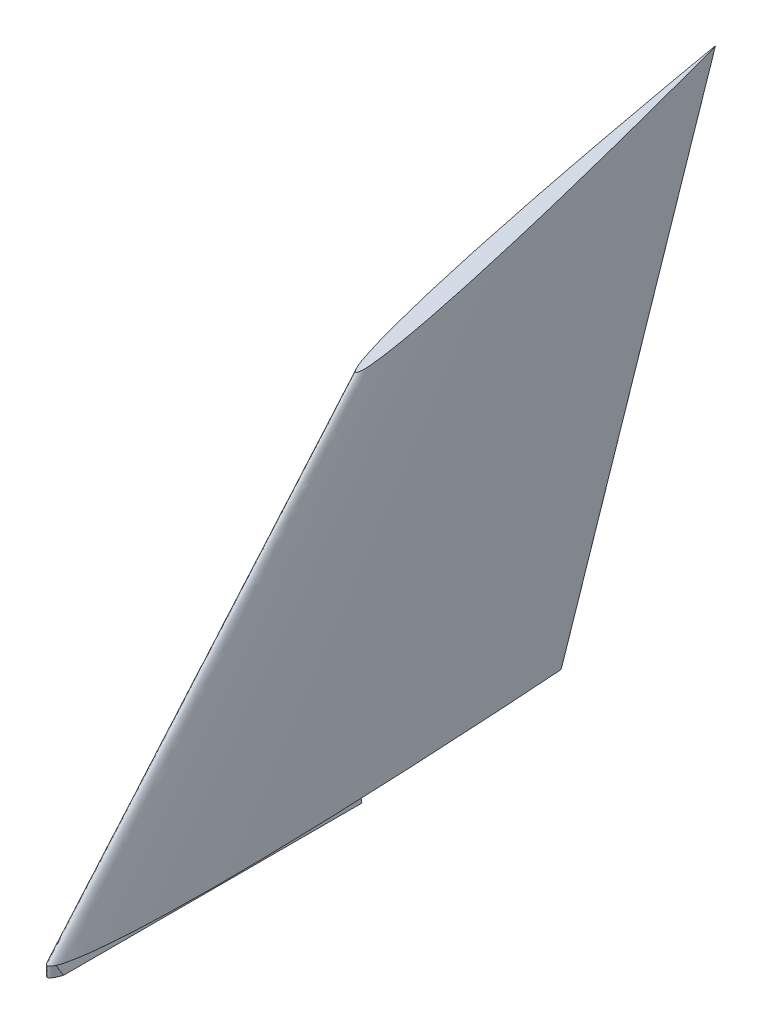
ISO-10303-21;
HEADER;
FILE_DESCRIPTION(('STEP AP214'),'2;1');
FILE_NAME('part.step','',(''),(''),'','','');
FILE_SCHEMA(('AUTOMOTIVE_DESIGN { 1 0 10303 214 1 1 1 1 }'));
ENDSEC;
DATA;
#1=APPLICATION_CONTEXT('core data for automotive mechanical design processes');
#2=APPLICATION_PROTOCOL_DEFINITION('international standard','automotive_design',2000,#1);
#3=PRODUCT_CONTEXT('',#1,'mechanical');
#4=PRODUCT('Part','Part','',(#3));
#5=PRODUCT_RELATED_PRODUCT_CATEGORY('part','',(#4));
#6=PRODUCT_DEFINITION_FORMATION('','',#4);
#7=PRODUCT_DEFINITION_CONTEXT('part definition',#1,'design');
#8=PRODUCT_DEFINITION('design','',#6,#7);
#9=PRODUCT_DEFINITION_SHAPE('','',#8);
#10=(LENGTH_UNIT() NAMED_UNIT(*) SI_UNIT(.MILLI.,.METRE.));
#11=(NAMED_UNIT(*) PLANE_ANGLE_UNIT() SI_UNIT($,.RADIAN.));
#12=(NAMED_UNIT(*) SI_UNIT($,.STERADIAN.) SOLID_ANGLE_UNIT());
#13=UNCERTAINTY_MEASURE_WITH_UNIT(LENGTH_MEASURE(1.E-05),#10,'distance_accuracy_value','');
#14=(GEOMETRIC_REPRESENTATION_CONTEXT(3) GLOBAL_UNCERTAINTY_ASSIGNED_CONTEXT((#13)) GLOBAL_UNIT_ASSIGNED_CONTEXT((#10,
#11,#12)) REPRESENTATION_CONTEXT('',''));
#15=CARTESIAN_POINT('',(0.,0.,0.));
#16=DIRECTION('',(0.,0.,1.));
#17=DIRECTION('',(1.,0.,0.));
#18=AXIS2_PLACEMENT_3D('',#15,#16,#17);
#19=CARTESIAN_POINT('',(0.4,0.,-30.));
#20=DIRECTION('',(0.98058067569092,0.196116135138184,0.));
#21=DIRECTION('',(-0.196116135138184,0.98058067569092,0.));
#22=AXIS2_PLACEMENT_3D('',#19,#20,#21);
#23=PLANE('',#22);
#24=DIRECTION('',(0.,0.,1.));
#25=VECTOR('',#24,1.);
#26=CARTESIAN_POINT('',(0.4,0.,-30.));
#27=LINE('',#26,#25);
#28=CARTESIAN_POINT('',(0.4,0.,-30.));
#29=VERTEX_POINT('',#28);
#30=CARTESIAN_POINT('',(0.399999999999814,0.,-0.454209676102204));
#31=VERTEX_POINT('',#30);
#32=EDGE_CURVE('E136',#29,#31,#27,.T.);
#33=ORIENTED_EDGE('',*,*,#32,.T.);
#34=CARTESIAN_POINT('',(0.399999999999901,0.,-0.454209676102168));
#35=CARTESIAN_POINT('',(0.408837300473484,-0.0441865023675952,-0.473053496078145));
#36=CARTESIAN_POINT('',(0.417634885450178,-0.0881744272509356,-0.492384061262309));
#37=CARTESIAN_POINT('',(0.435120510597668,-0.175602552988291,-0.531996119925799));
#38=CARTESIAN_POINT('',(0.443808772444676,-0.219043862223365,-0.552275070244527));
#39=CARTESIAN_POINT('',(0.46107307693216,-0.305365384660813,-0.593814586369523));
#40=CARTESIAN_POINT('',(0.46964931196724,-0.348246559836205,-0.61507307048998));
#41=CARTESIAN_POINT('',(0.486680959276207,-0.433404796381029,-0.658668969025825));
#42=CARTESIAN_POINT('',(0.495136523983628,-0.47568261991814,-0.681004830200858));
#43=CARTESIAN_POINT('',(0.511919557646701,-0.559597788233508,-0.727010122576347));
#44=CARTESIAN_POINT('',(0.520246875417697,-0.601234377088484,-0.750680994098539));
#45=CARTESIAN_POINT('',(0.536733319830674,-0.683666599153368,-0.799554600671502));
#46=CARTESIAN_POINT('',(0.544892357253607,-0.724461786268035,-0.82475812169643));
#47=CARTESIAN_POINT('',(0.561010746280223,-0.805053731401116,-0.876950165981431));
#48=CARTESIAN_POINT('',(0.568969685720734,-0.844848428603668,-0.903942013951729));
#49=CARTESIAN_POINT('',(0.584667672756584,-0.923338363782923,-0.95986167386739));
#50=CARTESIAN_POINT('',(0.592405736965954,-0.962028684829772,-0.98879665458486));
#51=CARTESIAN_POINT('',(0.599999999999998,-1.,-1.01869509705227));
#52=B_SPLINE_CURVE_WITH_KNOTS('',3,(#34,#35,#36,#37,#38,#39,#40,#41,#42,#43,#44,#45,#46,#47,#48,
#49,#50,#51),.UNSPECIFIED.,.F.,.F.,(4,2,2,2,2,2,2,2,4),(0.,0.146527403375212,0.292682195649871,
0.438539546633658,0.584192560073215,0.730005839580249,0.875894536249937,1.02206251109652,
1.16880300336692),.UNSPECIFIED.);
#53=CARTESIAN_POINT('',(0.600000015158689,-0.999999999999997,-1.01869515662808));
#54=VERTEX_POINT('',#53);
#55=EDGE_CURVE('E163',#31,#54,#52,.T.);
#56=ORIENTED_EDGE('',*,*,#55,.T.);
#57=DIRECTION('',(0.,0.,1.));
#58=VECTOR('',#57,1.);
#59=CARTESIAN_POINT('',(0.6,-1.,-30.));
#60=LINE('',#59,#58);
#61=CARTESIAN_POINT('',(0.6,-1.,-30.));
#62=VERTEX_POINT('',#61);
#63=EDGE_CURVE('E83',#62,#54,#60,.T.);
#64=ORIENTED_EDGE('',*,*,#63,.F.);
#65=DIRECTION('',(-0.196116135138184,0.98058067569092,0.));
#66=VECTOR('',#65,1.);
#67=CARTESIAN_POINT('',(0.4,0.,-30.));
#68=LINE('',#67,#66);
#69=EDGE_CURVE('E160',#62,#29,#68,.T.);
#70=ORIENTED_EDGE('',*,*,#69,.T.);
#71=EDGE_LOOP('',(#33,#56,#64,#70));
#72=FACE_BOUND('',#71,.T.);
#73=ADVANCED_FACE('F55',(#72),#23,.T.);
#74=CARTESIAN_POINT('',(-0.6,-1.,-30.));
#75=DIRECTION('',(0.,-1.,0.));
#76=DIRECTION('',(1.,0.,0.));
#77=AXIS2_PLACEMENT_3D('',#74,#75,#76);
#78=PLANE('',#77);
#79=ORIENTED_EDGE('',*,*,#63,.T.);
#80=CARTESIAN_POINT('',(-3.49160533385379E-13,-0.999999999999997,-50.));
#81=CARTESIAN_POINT('',(-0.070574794145528,-0.999999999999997,-50.));
#82=CARTESIAN_POINT('',(-0.211641076447674,-0.999999999999997,-47.1254578243524));
#83=CARTESIAN_POINT('',(-0.41198278936694,-0.999999999999997,-44.3840026286243));
#84=CARTESIAN_POINT('',(-0.663217827529071,-0.999999999999997,-39.9273470933078));
#85=CARTESIAN_POINT('',(-0.921106295060571,-0.999999999999997,-35.0205451655395));
#86=CARTESIAN_POINT('',(-1.14810694191173,-0.999999999999997,-29.9955902414363));
#87=CARTESIAN_POINT('',(-1.33225353387247,-0.999999999999997,-25.0022698373491));
#88=CARTESIAN_POINT('',(-1.46372016882197,-0.999999999999997,-20.0003386554011));
#89=CARTESIAN_POINT('',(-1.50961292044442,-0.999999999999997,-15.8334758537308));
#90=CARTESIAN_POINT('',(-1.49145088504206,-0.999999999999997,-12.4997333719351));
#91=CARTESIAN_POINT('',(-1.44210087645863,-0.999999999999997,-9.99945032426333));
#92=CARTESIAN_POINT('',(-1.34700278680778,-0.999999999999997,-7.49784702287007));
#93=CARTESIAN_POINT('',(-1.21482098047477,-0.999999999999997,-5.41578108448594));
#94=CARTESIAN_POINT('',(-1.05484298707573,-0.999999999999997,-3.74540160747368));
#95=CARTESIAN_POINT('',(-0.904008723191611,-0.999999999999997,-2.50391511144424));
#96=CARTESIAN_POINT('',(-0.696273378383395,-0.999999999999997,-1.42183800740736));
#97=CARTESIAN_POINT('',(-0.512523451047769,-0.999999999999997,-0.628600996921929));
#98=CARTESIAN_POINT('',(0.,-0.999999999999997,0.343595251004143));
#99=CARTESIAN_POINT('',(0.512523451047759,-0.999999999999997,-0.628600996921931));
#100=CARTESIAN_POINT('',(0.696273378383378,-0.999999999999997,-1.42183800740738));
#101=CARTESIAN_POINT('',(0.904008723191574,-0.999999999999997,-2.50391511144425));
#102=CARTESIAN_POINT('',(1.05484298707568,-0.999999999999997,-3.7454016074737));
#103=CARTESIAN_POINT('',(1.21482098047469,-0.999999999999997,-5.41578108448596));
#104=CARTESIAN_POINT('',(1.34700278680768,-0.999999999999997,-7.49784702287008));
#105=CARTESIAN_POINT('',(1.44210087645849,-0.999999999999997,-9.99945032426334));
#106=CARTESIAN_POINT('',(1.49145088504189,-0.999999999999997,-12.4997333719352));
#107=CARTESIAN_POINT('',(1.5096129204442,-0.999999999999997,-15.8334758537308));
#108=CARTESIAN_POINT('',(1.46372016882169,-0.999999999999997,-20.0003386554012));
#109=CARTESIAN_POINT('',(1.33225353387212,-0.999999999999997,-25.0022698373491));
#110=CARTESIAN_POINT('',(1.14810694191131,-0.999999999999997,-29.9955902414363));
#111=CARTESIAN_POINT('',(0.921106295060082,-0.999999999999997,-35.0205451655395));
#112=CARTESIAN_POINT('',(0.663217827528514,-0.999999999999997,-39.9273470933078));
#113=CARTESIAN_POINT('',(0.411982789366322,-0.999999999999997,-44.3840026286243));
#114=CARTESIAN_POINT('',(0.211641076447015,-0.999999999999997,-47.1254578243524));
#115=CARTESIAN_POINT('',(0.0705747941448297,-0.999999999999997,-50.));
#116=CARTESIAN_POINT('',(-3.49160533385379E-13,-0.999999999999997,-50.));
#117=B_SPLINE_CURVE_WITH_KNOTS('',3,(#80,#81,#82,#83,#84,#85,#86,#87,#88,#89,#90,#91,#92,#93,
#94,#95,#96,#97,#98,#99,#100,#101,#102,#103,#104,#105,#106,#107,#108,#109,#110,#111,#112,#113,
#114,#115,#116),.UNSPECIFIED.,.T.,.F.,(4,1,1,1,1,1,1,1,1,1,1,1,1,1,1,1,1,1,1,1,1,1,1,1,1,1,1,1,
1,1,1,1,1,1,4),(0.,0.0249466151164409,0.0498637834247188,0.099681635264649,0.149480780874934,
0.199263062412575,0.249028132484341,0.298776252358612,0.348510642813833,0.373377067097664,
0.398248217372172,0.423133291765915,0.448054024726348,0.460544649115496,0.473080977694483,
0.485731773975164,0.492200943481806,0.5,0.507799056518194,0.514268226024836,0.526919022305516,
0.539455350884504,0.551945975273652,0.576866708234085,0.601751782627828,0.626622932902336,
0.651489357186167,0.701223747641388,0.750971867515659,0.800736937587425,0.850519219125066,
0.900318364735351,0.950136216575281,0.975053384883559,1.),.UNSPECIFIED.);
#118=CARTESIAN_POINT('',(-0.60000001515869,-0.999999999999997,-1.01869515662802));
#119=VERTEX_POINT('',#118);
#120=EDGE_CURVE('E130',#54,#119,#117,.F.);
#121=ORIENTED_EDGE('',*,*,#120,.T.);
#122=DIRECTION('',(0.,0.,1.));
#123=VECTOR('',#122,1.);
#124=CARTESIAN_POINT('',(-0.6,-1.,-30.));
#125=LINE('',#124,#123);
#126=CARTESIAN_POINT('',(-0.6,-1.,-30.));
#127=VERTEX_POINT('',#126);
#128=EDGE_CURVE('E128',#127,#119,#125,.T.);
#129=ORIENTED_EDGE('',*,*,#128,.F.);
#130=DIRECTION('',(1.,0.,0.));
#131=VECTOR('',#130,1.);
#132=CARTESIAN_POINT('',(-0.6,-1.,-30.));
#133=LINE('',#132,#131);
#134=EDGE_CURVE('E142',#127,#62,#133,.T.);
#135=ORIENTED_EDGE('',*,*,#134,.T.);
#136=EDGE_LOOP('',(#79,#121,#129,#135));
#137=FACE_BOUND('',#136,.T.);
#138=ADVANCED_FACE('F204',(#137),#78,.T.);
#139=CARTESIAN_POINT('',(-0.6,-1.,-30.));
#140=DIRECTION('',(-0.98058067569092,0.196116135138184,0.));
#141=DIRECTION('',(-0.196116135138184,-0.98058067569092,0.));
#142=AXIS2_PLACEMENT_3D('',#139,#140,#141);
#143=PLANE('',#142);
#144=ORIENTED_EDGE('',*,*,#128,.T.);
#145=CARTESIAN_POINT('',(-0.6,-0.999999999999999,-1.01869509705221));
#146=CARTESIAN_POINT('',(-0.592405736986242,-0.962028684931211,-0.988796654664981));
#147=CARTESIAN_POINT('',(-0.584667672797956,-0.923338363989782,-0.959861674022255));
#148=CARTESIAN_POINT('',(-0.568969685805341,-0.844848429026704,-0.903942014245736));
#149=CARTESIAN_POINT('',(-0.561010746386974,-0.805053731934868,-0.876950166339899));
#150=CARTESIAN_POINT('',(-0.544892357405485,-0.724461787027425,-0.824758122175213));
#151=CARTESIAN_POINT('',(-0.536733320005533,-0.683666600027667,-0.799554601206164));
#152=CARTESIAN_POINT('',(-0.520246875639106,-0.601234378195531,-0.750680994738556));
#153=CARTESIAN_POINT('',(-0.511919557891679,-0.559597789458392,-0.727010123265844));
#154=CARTESIAN_POINT('',(-0.495136524276056,-0.47568262138028,-0.681004830984453));
#155=CARTESIAN_POINT('',(-0.486680959592517,-0.433404797962583,-0.658668969854048));
#156=CARTESIAN_POINT('',(-0.469649312331655,-0.348246561658274,-0.615073071403956));
#157=CARTESIAN_POINT('',(-0.461073077320797,-0.305365386603987,-0.593814587324613));
#158=CARTESIAN_POINT('',(-0.443808772882201,-0.219043864411007,-0.552275071277253));
#159=CARTESIAN_POINT('',(-0.43512051105986,-0.175602555299301,-0.531996120995032));
#160=CARTESIAN_POINT('',(-0.417634885962181,-0.0881744298109035,-0.492384062400034));
#161=CARTESIAN_POINT('',(-0.408837301010631,-0.0441865050531612,-0.473053497247837));
#162=CARTESIAN_POINT('',(-0.40000000056237,-2.81186212025506E-09,-0.454209677301459));
#163=B_SPLINE_CURVE_WITH_KNOTS('',3,(#145,#146,#147,#148,#149,#150,#151,#152,#153,#154,#155,
#156,#157,#158,#159,#160,#161,#162),.UNSPECIFIED.,.F.,.F.,(4,2,2,2,2,2,2,2,4),(0.,
0.146740491878042,0.292908466335859,0.438797162618223,0.584610441738217,0.730263454791862,
0.876120805388567,1.02227559727454,1.16880300025899),.UNSPECIFIED.);
#164=CARTESIAN_POINT('',(-0.399999999999998,0.,-0.454209676102577));
#165=VERTEX_POINT('',#164);
#166=EDGE_CURVE('E119',#119,#165,#163,.T.);
#167=ORIENTED_EDGE('',*,*,#166,.T.);
#168=DIRECTION('',(0.,0.,1.));
#169=VECTOR('',#168,1.);
#170=CARTESIAN_POINT('',(-0.4,0.,-30.));
#171=LINE('',#170,#169);
#172=CARTESIAN_POINT('',(-0.4,0.,-30.));
#173=VERTEX_POINT('',#172);
#174=EDGE_CURVE('E126',#173,#165,#171,.T.);
#175=ORIENTED_EDGE('',*,*,#174,.F.);
#176=DIRECTION('',(-0.196116135138184,-0.98058067569092,0.));
#177=VECTOR('',#176,1.);
#178=CARTESIAN_POINT('',(-0.6,-1.,-30.));
#179=LINE('',#178,#177);
#180=EDGE_CURVE('E155',#173,#127,#179,.T.);
#181=ORIENTED_EDGE('',*,*,#180,.T.);
#182=EDGE_LOOP('',(#144,#167,#175,#181));
#183=FACE_BOUND('',#182,.T.);
#184=ADVANCED_FACE('F124',(#183),#143,.T.);
#185=CARTESIAN_POINT('',(0.,24.433962264151,6.9811320754717));
#186=DIRECTION('',(0.,-0.961523947640823,-0.274721127897378));
#187=DIRECTION('',(0.,0.274721127897378,-0.961523947640823));
#188=AXIS2_PLACEMENT_3D('',#185,#186,#187);
#189=PLANE('',#188);
#190=CARTESIAN_POINT('',(-1.84490552208565E-13,44.9999999909774,-64.999999968421));
#191=CARTESIAN_POINT('',(-0.000708816346992176,44.9999995800347,-64.9999985301212));
#192=CARTESIAN_POINT('',(-0.00140434157249662,44.999901487007,-64.9996552045245));
#193=CARTESIAN_POINT('',(-0.00260369794931761,44.9996405686008,-64.9987419901028));
#194=CARTESIAN_POINT('',(-0.00308454833750058,44.9994726978374,-64.9981544424308));
#195=CARTESIAN_POINT('',(-0.00432152793766173,44.998973360216,-64.996406760756));
#196=CARTESIAN_POINT('',(-0.00497346998556253,44.9986220656494,-64.9951772297728));
#197=CARTESIAN_POINT('',(-0.00613852352663751,44.997901381822,-64.9926548363772));
#198=CARTESIAN_POINT('',(-0.00665010684580063,44.9975318413973,-64.9913614448906));
#199=CARTESIAN_POINT('',(-0.0080594247913127,44.9964229316872,-64.9874802609052));
#200=CARTESIAN_POINT('',(-0.00884956474235709,44.9956729943478,-64.9848554802175));
#201=CARTESIAN_POINT('',(-0.0102944472165565,44.9941632240032,-64.9795712840113));
#202=CARTESIAN_POINT('',(-0.0109489644507413,44.9934033767262,-64.9769118185417));
#203=CARTESIAN_POINT('',(-0.0127828631829115,44.9911225959096,-64.9689290856836));
#204=CARTESIAN_POINT('',(-0.0138391046021227,44.9895941316569,-64.9635794607992));
#205=CARTESIAN_POINT('',(-0.016764826560526,44.985010582645,-64.9475370392575));
#206=CARTESIAN_POINT('',(-0.0184017394680769,44.981945069795,-64.9368077442825));
#207=CARTESIAN_POINT('',(-0.021402666565266,44.975802485014,-64.9153086975492));
#208=CARTESIAN_POINT('',(-0.0227665016287908,44.972725406836,-64.9045389239259));
#209=CARTESIAN_POINT('',(-0.0253255282268459,44.9665635617961,-64.8829724662862));
#210=CARTESIAN_POINT('',(-0.0265205869104212,44.963478790801,-64.8721757678036));
#211=CARTESIAN_POINT('',(-0.0287951650934477,44.9573069885847,-64.8505744600463));
#212=CARTESIAN_POINT('',(-0.0298747178862714,44.9542199582743,-64.8397698539599));
#213=CARTESIAN_POINT('',(-0.0350703181539467,44.9387988481563,-64.7857959685471));
#214=CARTESIAN_POINT('',(-0.0386009435353585,44.9264501054062,-64.7425753689217));
#215=CARTESIAN_POINT('',(-0.0451488852960223,44.901740894774,-64.6560931317091));
#216=CARTESIAN_POINT('',(-0.0481661013065703,44.8893804250733,-64.6128314877566));
#217=CARTESIAN_POINT('',(-0.0538855553836543,44.8646599415723,-64.5263097955031));
#218=CARTESIAN_POINT('',(-0.0565879462115356,44.8522999304846,-64.4830497566962));
#219=CARTESIAN_POINT('',(-0.0617957365612349,44.8275778639606,-64.3965225238622));
#220=CARTESIAN_POINT('',(-0.0643011520287419,44.8152158087712,-64.3532553306991));
#221=CARTESIAN_POINT('',(-0.0716191510766704,44.7781315240139,-64.2234603340486));
#222=CARTESIAN_POINT('',(-0.0762345388690415,44.753406366547,-64.1369222829145));
#223=CARTESIAN_POINT('',(-0.0852399809732615,44.7039529551418,-63.9638353429963));
#224=CARTESIAN_POINT('',(-0.0896300343765512,44.6792247011914,-63.87728645417));
#225=CARTESIAN_POINT('',(-0.0983778144920944,44.6297670101722,-63.7041845356026));
#226=CARTESIAN_POINT('',(-0.102735540242417,44.60503757309,-63.6176315058148));
#227=CARTESIAN_POINT('',(-0.111664204442628,44.555581663667,-63.4445358228344));
#228=CARTESIAN_POINT('',(-0.116235142221777,44.5308551913171,-63.35799316961));
#229=CARTESIAN_POINT('',(-0.130327455838209,44.4566760292115,-63.0983661022404));
#230=CARTESIAN_POINT('',(-0.140227460115069,44.4072287375825,-62.9253005815387));
#231=CARTESIAN_POINT('',(-0.155685190832781,44.3330674340758,-62.6657360192653));
#232=CARTESIAN_POINT('',(-0.160939064887745,44.3083485618054,-62.579219966319));
#233=CARTESIAN_POINT('',(-0.171533985391315,44.2589122298234,-62.4061928043821));
#234=CARTESIAN_POINT('',(-0.176875031843761,44.2341947701119,-62.3196816953916));
#235=CARTESIAN_POINT('',(-0.187485627425379,44.1847588837475,-62.1466560931162));
#236=CARTESIAN_POINT('',(-0.192755177135094,44.1600404571041,-62.0601415998645));
#237=CARTESIAN_POINT('',(-0.203114097394125,44.110600755843,-61.8871026454504));
#238=CARTESIAN_POINT('',(-0.208203467981341,44.0858794812258,-61.8005781842902));
#239=CARTESIAN_POINT('',(-0.22326711470282,44.0117125306255,-61.5409938571893));
#240=CARTESIAN_POINT('',(-0.233036926423564,43.9622637249679,-61.3679230373875));
#241=CARTESIAN_POINT('',(-0.252173760719579,43.863360277701,-61.0217609719534));
#242=CARTESIAN_POINT('',(-0.261540783390271,43.8139056360931,-60.8486697263259));
#243=CARTESIAN_POINT('',(-0.279977801070607,43.7149921652463,-60.502472578362));
#244=CARTESIAN_POINT('',(-0.28904779596561,43.6655333360057,-60.3293666760198));
#245=CARTESIAN_POINT('',(-0.315922640868918,43.5171564933201,-59.8100477266203));
#246=CARTESIAN_POINT('',(-0.333393149493689,43.4182339264138,-59.4638187424484));
#247=CARTESIAN_POINT('',(-0.367936142137983,43.2203835962422,-58.7713425868478));
#248=CARTESIAN_POINT('',(-0.38500862616237,43.121455832977,-58.4250954154195));
#249=CARTESIAN_POINT('',(-0.41867765186675,42.9235953197935,-57.7325836192773));
#250=CARTESIAN_POINT('',(-0.435274199098067,42.8246625699469,-57.3863189948143));
#251=CARTESIAN_POINT('',(-0.467858027461269,42.6267895676372,-56.6937634867301));
#252=CARTESIAN_POINT('',(-0.483845309036639,42.5278493151795,-56.3474726031283));
#253=CARTESIAN_POINT('',(-0.530752049438272,42.2310149112747,-55.3085521894614));
#254=CARTESIAN_POINT('',(-0.560616236803553,42.0331080834801,-54.6158782921803));
#255=CARTESIAN_POINT('',(-0.617471965713077,41.6372603975655,-53.2304113914791));
#256=CARTESIAN_POINT('',(-0.644463465268378,41.4393195389904,-52.5376183864662));
#257=CARTESIAN_POINT('',(-0.695315948174649,41.0434074263362,-51.1519259921767));
#258=CARTESIAN_POINT('',(-0.71917693295034,40.845436172271,-50.4590266029485));
#259=CARTESIAN_POINT('',(-0.763394787028041,40.4494501448892,-49.0730755071121));
#260=CARTESIAN_POINT('',(-0.783751412717522,40.2514353695043,-48.3800237932652));
#261=CARTESIAN_POINT('',(-0.820297193064685,39.8553767944793,-46.9938187806775));
#262=CARTESIAN_POINT('',(-0.83648635660223,39.6573329949018,-46.3006654821563));
#263=CARTESIAN_POINT('',(-0.863892780266229,39.2611712932497,-44.9140995263741));
#264=CARTESIAN_POINT('',(-0.875108842706751,39.0630533848127,-44.2206868468444));
#265=CARTESIAN_POINT('',(-0.891561182288187,38.6667986355315,-42.8337952243602));
#266=CARTESIAN_POINT('',(-0.896797491243574,38.4686617947937,-42.1403162817778));
#267=CARTESIAN_POINT('',(-0.899319775111566,38.1714709245551,-41.1001482359427));
#268=CARTESIAN_POINT('',(-0.899272078006738,38.0724183962283,-40.753464386799));
#269=CARTESIAN_POINT('',(-0.897126967497457,37.8743148201528,-40.060101870535));
#270=CARTESIAN_POINT('',(-0.895029554588109,37.7752637724039,-39.7134232034135));
#271=CARTESIAN_POINT('',(-0.888515316540742,37.5771687129906,-39.0200904954671));
#272=CARTESIAN_POINT('',(-0.884098523971665,37.4781247012471,-38.6734364543647));
#273=CARTESIAN_POINT('',(-0.872686532821064,37.2800479506915,-37.9801678274204));
#274=CARTESIAN_POINT('',(-0.865691342863123,37.181015211843,-37.6335532414504));
#275=CARTESIAN_POINT('',(-0.848655676217542,36.9829681734152,-36.9403886069531));
#276=CARTESIAN_POINT('',(-0.838615167394277,36.8839538740416,-36.5938385591455));
#277=CARTESIAN_POINT('',(-0.815029480471092,36.6859567649045,-35.9008486771657));
#278=CARTESIAN_POINT('',(-0.80148432796415,36.5869739549164,-35.5544088422072));
#279=CARTESIAN_POINT('',(-0.769734587289353,36.3890182638801,-34.8615639235802));
#280=CARTESIAN_POINT('',(-0.751527883973594,36.2900454077966,-34.515158927288));
#281=CARTESIAN_POINT('',(-0.709267108809896,36.0921943605985,-33.8226802620947));
#282=CARTESIAN_POINT('',(-0.685213179104209,35.9933161672414,-33.4766065853449));
#283=CARTESIAN_POINT('',(-0.644046417903947,35.8450609389504,-32.9577132863263));
#284=CARTESIAN_POINT('',(-0.629468839795096,35.7956307195506,-32.784707518427));
#285=CARTESIAN_POINT('',(-0.597098632005392,35.6968519038369,-32.4389816634293));
#286=CARTESIAN_POINT('',(-0.579306373564407,35.6475032987614,-32.266261545665));
#287=CARTESIAN_POINT('',(-0.549217321854868,35.5736095053546,-32.0076332687412));
#288=CARTESIAN_POINT('',(-0.538626806984539,35.549011632495,-31.9215407137325));
#289=CARTESIAN_POINT('',(-0.516439970353316,35.4998500961972,-31.74947533669));
#290=CARTESIAN_POINT('',(-0.504843641555028,35.4752864329995,-31.6635025154983));
#291=CARTESIAN_POINT('',(-0.480731083097649,35.4261893413677,-31.4916626947869));
#292=CARTESIAN_POINT('',(-0.468214711048167,35.4016559182135,-31.4057957137472));
#293=CARTESIAN_POINT('',(-0.442273933442398,35.3526253497468,-31.2341887241138));
#294=CARTESIAN_POINT('',(-0.428849524964212,35.3281282045513,-31.1484487159294));
#295=CARTESIAN_POINT('',(-0.410417439193775,35.2955292763816,-31.0343524673354));
#296=CARTESIAN_POINT('',(-0.405780676227837,35.287411749262,-31.0059411224171));
#297=CARTESIAN_POINT('',(-0.396245864152084,35.271188415967,-30.9491594558846));
#298=CARTESIAN_POINT('',(-0.39134781606361,35.2630826097459,-30.9207891341106));
#299=CARTESIAN_POINT('',(-0.375897836781132,35.2388014906811,-30.8358052173837));
#300=CARTESIAN_POINT('',(-0.364588929773895,35.2226602349242,-30.7793108222348));
#301=CARTESIAN_POINT('',(-0.345340285229791,35.1985694745783,-30.694993161024));
#302=CARTESIAN_POINT('',(-0.338535189735722,35.1905514034355,-30.6669299120242));
#303=CARTESIAN_POINT('',(-0.324148019802174,35.1745674410779,-30.6109860437725));
#304=CARTESIAN_POINT('',(-0.316565893085733,35.1666015534122,-30.5831054369428));
#305=CARTESIAN_POINT('',(-0.300658742675741,35.150731020652,-30.5275585722819));
#306=CARTESIAN_POINT('',(-0.2923341560683,35.1428263424637,-30.499892198623));
#307=CARTESIAN_POINT('',(-0.274925083957135,35.1270810057834,-30.444783520242));
#308=CARTESIAN_POINT('',(-0.265840664747658,35.1192403417717,-30.4173411962008));
#309=CARTESIAN_POINT('',(-0.246749706260101,35.1036182006975,-30.3626637024413));
#310=CARTESIAN_POINT('',(-0.2367405866759,35.0958369591212,-30.335429356924));
#311=CARTESIAN_POINT('',(-0.215564155258917,35.080377074555,-30.2813197609424));
#312=CARTESIAN_POINT('',(-0.204394680846955,35.0726986543742,-30.2544452903095));
#313=CARTESIAN_POINT('',(-0.180465447977806,35.0575087211553,-30.2012805240435));
#314=CARTESIAN_POINT('',(-0.167703083157766,35.0499975060036,-30.1749912710127));
#315=CARTESIAN_POINT('',(-0.146703861534257,35.0390109252018,-30.1365382382063));
#316=CARTESIAN_POINT('',(-0.139407208576433,35.035400661203,-30.1239023142106));
#317=CARTESIAN_POINT('',(-0.123970030307618,35.0283201698381,-30.0991205944332));
#318=CARTESIAN_POINT('',(-0.115830446067278,35.0248497921884,-30.0869742726594));
#319=CARTESIAN_POINT('',(-0.102628725287237,35.0197934075801,-30.0692769265304));
#320=CARTESIAN_POINT('',(-0.0980182117957216,35.0181189254455,-30.063416239059));
#321=CARTESIAN_POINT('',(-0.0883973934927318,35.0148557431203,-30.0519951009212));
#322=CARTESIAN_POINT('',(-0.0833867387770498,35.0132671200904,-30.0464349203167));
#323=CARTESIAN_POINT('',(-0.0729306333419201,35.0102382956125,-30.0358340346434));
#324=CARTESIAN_POINT('',(-0.0674919921902941,35.0087963750758,-30.0307873127638));
#325=CARTESIAN_POINT('',(-0.0560192844997266,35.0061082598352,-30.0213789094247));
#326=CARTESIAN_POINT('',(-0.0499856226670584,35.0048619335719,-30.0170167675066));
#327=CARTESIAN_POINT('',(-0.034854483375692,35.002303332597,-30.0080616640956));
#328=CARTESIAN_POINT('',(-0.0254208187982125,35.0011185619998,-30.003914967));
#329=CARTESIAN_POINT('',(-0.0117104454253582,35.0002532337197,-30.0008863180186));
#330=CARTESIAN_POINT('',(-0.00783950697860743,35.0000956301598,-30.0003347055592));
#331=CARTESIAN_POINT('',(-5.78670780484894E-05,34.9999691122279,-29.9998918927977));
#332=CARTESIAN_POINT('',(0.00385280886327786,35.0000000835912,-30.0000002925692));
#333=CARTESIAN_POINT('',(0.0154291683011515,35.0003686587579,-30.0012903056525));
#334=CARTESIAN_POINT('',(0.022982813643617,35.0009792669098,-30.0034274341843));
#335=CARTESIAN_POINT('',(0.036143761986832,35.0025487382276,-30.0089205837968));
#336=CARTESIAN_POINT('',(0.0418719374154893,35.0034398865899,-30.0120396030646));
#337=CARTESIAN_POINT('',(0.0528049351889544,35.0054436038071,-30.0190526133249));
#338=CARTESIAN_POINT('',(0.0580080156007643,35.0065568753737,-30.022949063808));
#339=CARTESIAN_POINT('',(0.0695670299548175,35.0093110804245,-30.0325887814858));
#340=CARTESIAN_POINT('',(0.0757486297377144,35.0110059642454,-30.0385208748588));
#341=CARTESIAN_POINT('',(0.0874891960012822,35.014545055108,-30.050907692878));
#342=CARTESIAN_POINT('',(0.0930485676919336,35.0163891636067,-30.0573620726235));
#343=CARTESIAN_POINT('',(0.109091984179298,35.0220916052334,-30.0773206183171));
#344=CARTESIAN_POINT('',(0.118865196788276,35.0260994283272,-30.091347999145));
#345=CARTESIAN_POINT('',(0.136862153592007,35.0341578430571,-30.1195524506998));
#346=CARTESIAN_POINT('',(0.145129808470385,35.038201382006,-30.1337048370209));
#347=CARTESIAN_POINT('',(0.160862599075669,35.0464056748112,-30.1624198618391));
#348=CARTESIAN_POINT('',(0.168327491103909,35.0505664637806,-30.176982623232));
#349=CARTESIAN_POINT('',(0.18985229275449,35.0631815939265,-30.2211355787429));
#350=CARTESIAN_POINT('',(0.203006675051444,35.0717514579676,-30.2511301028865));
#351=CARTESIAN_POINT('',(0.22773918853648,35.0890549866129,-30.3116924531453));
#352=CARTESIAN_POINT('',(0.239317549154431,35.0977886271644,-30.3422601950753));
#353=CARTESIAN_POINT('',(0.261285783855421,35.1153702382218,-30.4037958337763));
#354=CARTESIAN_POINT('',(0.2716752170253,35.1242182497972,-30.43476387429));
#355=CARTESIAN_POINT('',(0.307764599410566,35.156603998338,-30.5481139941827));
#356=CARTESIAN_POINT('',(0.330574099632526,35.1803922883637,-30.6313730092727));
#357=CARTESIAN_POINT('',(0.359691494256883,35.2163996762716,-30.7573988669506));
#358=CARTESIAN_POINT('',(0.368554673085197,35.2284696039564,-30.7996436138475));
#359=CARTESIAN_POINT('',(0.384939949205861,35.252680130609,-30.8843804571314));
#360=CARTESIAN_POINT('',(0.392461753930467,35.2648207443993,-30.9268726053974));
#361=CARTESIAN_POINT('',(0.40323993304325,35.2830615033368,-30.9907152616787));
#362=CARTESIAN_POINT('',(0.406750779485767,35.2891508666156,-31.0120280331544));
#363=CARTESIAN_POINT('',(0.413707429231675,35.3013324020629,-31.0546634072202));
#364=CARTESIAN_POINT('',(0.417153233081469,35.3074245742075,-31.0759860097261));
#365=CARTESIAN_POINT('',(0.427408396379546,35.3257034677966,-31.1399621372882));
#366=CARTESIAN_POINT('',(0.434136126995028,35.3378936355748,-31.1826277245119));
#367=CARTESIAN_POINT('',(0.44737292659703,35.362289978562,-31.268014924967));
#368=CARTESIAN_POINT('',(0.453881869908133,35.3744961589236,-31.3107365562326));
#369=CARTESIAN_POINT('',(0.466678603288508,35.3989174434162,-31.3962110519568));
#370=CARTESIAN_POINT('',(0.472966389952214,35.4111325476817,-31.4389639168859));
#371=CARTESIAN_POINT('',(0.491472634553102,35.4477535184944,-31.5671373147302));
#372=CARTESIAN_POINT('',(0.503354210618355,35.4721723058804,-31.6526030705815));
#373=CARTESIAN_POINT('',(0.526160232000424,35.5210270473931,-31.823594665876));
#374=CARTESIAN_POINT('',(0.537085312943527,35.5454629790733,-31.9091204267566));
#375=CARTESIAN_POINT('',(0.557772561344882,35.5942061892237,-32.0797216622829));
#376=CARTESIAN_POINT('',(0.567542026881188,35.6185132333309,-32.1647963166581));
#377=CARTESIAN_POINT('',(0.586055105800513,35.6671568622193,-32.3350490177676));
#378=CARTESIAN_POINT('',(0.59479870926772,35.6914934472838,-32.4202270654933));
#379=CARTESIAN_POINT('',(0.619746665155171,35.7645419974809,-32.6758969911833));
#380=CARTESIAN_POINT('',(0.634665747481772,35.8132869035984,-32.8465041625944));
#381=CARTESIAN_POINT('',(0.655609848245587,35.8864354869756,-33.1025242044148));
#382=CARTESIAN_POINT('',(0.662352371609733,35.9108245386829,-33.18788588539));
#383=CARTESIAN_POINT('',(0.675439678053145,35.9596106999179,-33.3586374497127));
#384=CARTESIAN_POINT('',(0.681784462850206,35.9840078094105,-33.4440273329366));
#385=CARTESIAN_POINT('',(0.700241198397243,36.0572625146151,-33.7004188011529));
#386=CARTESIAN_POINT('',(0.711760720542848,36.1061314180261,-33.8714599630915));
#387=CARTESIAN_POINT('',(0.733347692469568,36.2038883260865,-34.2136091413026));
#388=CARTESIAN_POINT('',(0.743415288598763,36.2527763283119,-34.3847171490917));
#389=CARTESIAN_POINT('',(0.762229811226574,36.350570122435,-34.7269954285224));
#390=CARTESIAN_POINT('',(0.770976772491519,36.3994759138303,-34.8981656984059));
#391=CARTESIAN_POINT('',(0.791343720552462,36.5216286477753,-35.3257002672136));
#392=CARTESIAN_POINT('',(0.802229069108464,36.5948848246146,-35.582096886151));
#393=CARTESIAN_POINT('',(0.821873804365202,36.7414204191405,-36.0949714669919));
#394=CARTESIAN_POINT('',(0.830633127916024,36.8146998374529,-36.351449431085));
#395=CARTESIAN_POINT('',(0.846320404390583,36.9612401788604,-36.8643406260113));
#396=CARTESIAN_POINT('',(0.853249185150123,37.0345010952957,-37.120753833535));
#397=CARTESIAN_POINT('',(0.865460522673109,37.1810323489406,-37.6336132212922));
#398=CARTESIAN_POINT('',(0.870743095264432,37.2543026860529,-37.890059401185));
#399=CARTESIAN_POINT('',(0.888467890601642,37.539086530076,-38.8868028552661));
#400=CARTESIAN_POINT('',(0.895615893437889,37.7506261185685,-39.6271914149899));
#401=CARTESIAN_POINT('',(0.899302432741376,38.0679536561753,-40.7378377966136));
#402=CARTESIAN_POINT('',(0.899358423742335,38.1737410194347,-41.1080935680216));
#403=CARTESIAN_POINT('',(0.89744058235908,38.3853143778377,-41.8486003224319));
#404=CARTESIAN_POINT('',(0.89546675361917,38.4911003729834,-42.2188513054418));
#405=CARTESIAN_POINT('',(0.88678741261994,38.8085095411634,-43.329783394072));
#406=CARTESIAN_POINT('',(0.877323625417847,39.0201271260343,-44.0704449411202));
#407=CARTESIAN_POINT('',(0.852294982775084,39.443324309766,-45.5516350841812));
#408=CARTESIAN_POINT('',(0.836730402350309,39.6549039099091,-46.2921636846818));
#409=CARTESIAN_POINT('',(0.800569428462125,40.0779431877239,-47.7728011570337));
#410=CARTESIAN_POINT('',(0.779975104188337,40.2894028789598,-48.5129100763593));
#411=CARTESIAN_POINT('',(0.734665084932468,40.712271190886,-49.9929491681008));
#412=CARTESIAN_POINT('',(0.709949730101039,40.9236798143503,-50.7328793502259));
#413=CARTESIAN_POINT('',(0.670118982894872,41.2407679377841,-51.8426877822445));
#414=CARTESIAN_POINT('',(0.656382329495578,41.3464606721557,-52.2126123525448));
#415=CARTESIAN_POINT('',(0.628055948700473,41.5578392407361,-52.9524373425762));
#416=CARTESIAN_POINT('',(0.613466207326692,41.6635250748035,-53.3223377618122));
#417=CARTESIAN_POINT('',(0.568461328725602,41.9805696688945,-54.4319938411306));
#418=CARTESIAN_POINT('',(0.536810563979769,42.1919153074064,-55.1717035759224));
#419=CARTESIAN_POINT('',(0.47024741782697,42.614566760167,-56.6509836605845));
#420=CARTESIAN_POINT('',(0.43533504868752,42.8258725745624,-57.3905540109685));
#421=CARTESIAN_POINT('',(0.380879667899244,43.1456141550088,-58.5096495425309));
#422=CARTESIAN_POINT('',(0.362126880172403,43.2540602340375,-58.8892108191314));
#423=CARTESIAN_POINT('',(0.324097085130251,43.4709457520818,-59.6483101322864));
#424=CARTESIAN_POINT('',(0.304820076786579,43.579385191084,-60.0278481687939));
#425=CARTESIAN_POINT('',(0.271626305572563,43.7603324683228,-60.6611636391298));
#426=CARTESIAN_POINT('',(0.258048955143918,43.8328449611249,-60.914957363937));
#427=CARTESIAN_POINT('',(0.237046545429159,43.9416043007422,-61.2956150525979));
#428=CARTESIAN_POINT('',(0.229939691250426,43.9778557835394,-61.422495242388));
#429=CARTESIAN_POINT('',(0.215463505442788,44.0503547855323,-61.6762417493629));
#430=CARTESIAN_POINT('',(0.208094174050064,44.0866023047314,-61.80310806656));
#431=CARTESIAN_POINT('',(0.195485941496599,44.1470893618135,-62.0148127663472));
#432=CARTESIAN_POINT('',(0.190349651682893,44.1713305150516,-62.0996568026804));
#433=CARTESIAN_POINT('',(0.179975274783074,44.219811192306,-62.2693391730711));
#434=CARTESIAN_POINT('',(0.174737187582449,44.2440507163205,-62.3541775071218));
#435=CARTESIAN_POINT('',(0.164319406368129,44.2925306833158,-62.5238573916052));
#436=CARTESIAN_POINT('',(0.159139712266539,44.316771126295,-62.6086989420327));
#437=CARTESIAN_POINT('',(0.148949983756171,44.3652546874365,-62.7783914060279));
#438=CARTESIAN_POINT('',(0.143939949163034,44.3894978055958,-62.8632423195853));
#439=CARTESIAN_POINT('',(0.132491649506081,44.4461523036401,-63.0615330627404));
#440=CARTESIAN_POINT('',(0.126140601865275,44.4785650228305,-63.1749775799069));
#441=CARTESIAN_POINT('',(0.113884735940317,44.5433968786352,-63.4018890752232));
#442=CARTESIAN_POINT('',(0.107979918729772,44.5758160152647,-63.5153560534264));
#443=CARTESIAN_POINT('',(0.0983358827086711,44.6298991900495,-63.7046471651734));
#444=CARTESIAN_POINT('',(0.094528249740048,44.651562321844,-63.7804681264539));
#445=CARTESIAN_POINT('',(0.086844067707567,44.6948876397362,-63.9321067390768));
#446=CARTESIAN_POINT('',(0.0829675187041123,44.7165498258349,-64.0079243904222));
#447=CARTESIAN_POINT('',(0.0736823838834664,44.7671793564003,-64.1851277474012));
#448=CARTESIAN_POINT('',(0.068198157227374,44.7961456885511,-64.2865099099289));
#449=CARTESIAN_POINT('',(0.0583070044702544,44.844478149016,-64.455673521556));
#450=CARTESIAN_POINT('',(0.0541444603036257,44.8638479479524,-64.5234678178335));
#451=CARTESIAN_POINT('',(0.0465264106775398,44.8961671839557,-64.6365851438448));
#452=CARTESIAN_POINT('',(0.0432926490290556,44.9091204577293,-64.6819216020527));
#453=CARTESIAN_POINT('',(0.0373214102355185,44.9307322636996,-64.7575629229487));
#454=CARTESIAN_POINT('',(0.0347733986559084,44.9393946347097,-64.7878812214839));
#455=CARTESIAN_POINT('',(0.0300396160235739,44.9538459765008,-64.8384609177528));
#456=CARTESIAN_POINT('',(0.0280122875581865,44.9596387515146,-64.858735630301));
#457=CARTESIAN_POINT('',(0.0242287170066224,44.9693014371191,-64.8925550299168));
#458=CARTESIAN_POINT('',(0.0226037649444054,44.9731751088224,-64.9061128808784));
#459=CARTESIAN_POINT('',(0.0195600798903576,44.9796352430355,-64.9287233506243));
#460=CARTESIAN_POINT('',(0.0182497033557696,44.9822254449533,-64.9377890573363));
#461=CARTESIAN_POINT('',(0.0157874110954152,44.9865438027883,-64.9529033097592));
#462=CARTESIAN_POINT('',(0.0147248107243495,44.9882756692716,-64.9589648424507));
#463=CARTESIAN_POINT('',(0.012722003202592,44.9911615060446,-64.9690652711561));
#464=CARTESIAN_POINT('',(0.0118554293212178,44.9923192296067,-64.9731173036232));
#465=CARTESIAN_POINT('',(0.0102166648556135,44.9942470384728,-64.9798646346548));
#466=CARTESIAN_POINT('',(0.0095053018559918,44.9950208447774,-64.982572956721));
#467=CARTESIAN_POINT('',(0.00815493381950576,44.9963072732799,-64.9870754564798));
#468=CARTESIAN_POINT('',(0.00756626300163699,44.9968238413015,-64.9888834445551));
#469=CARTESIAN_POINT('',(0.00644298168422076,44.997681518264,-64.9918853139238));
#470=CARTESIAN_POINT('',(0.00595027030258157,44.9980263948464,-64.9930923819625));
#471=CARTESIAN_POINT('',(0.00500439637174534,44.9985946942271,-64.9950814297951));
#472=CARTESIAN_POINT('',(0.00458597169654932,44.9988227468628,-64.9958796140199));
#473=CARTESIAN_POINT('',(0.0036059877178721,44.9992774401292,-64.9974710404522));
#474=CARTESIAN_POINT('',(0.00303758307169403,44.9995032460016,-64.9982613610054));
#475=CARTESIAN_POINT('',(0.00204625274581811,44.9997656616491,-64.9991798157718));
#476=CARTESIAN_POINT('',(0.00174064311282504,44.9998345023582,-64.9994207582539));
#477=CARTESIAN_POINT('',(0.000968531726985882,44.9999555290741,-64.9998443517593));
#478=CARTESIAN_POINT('',(0.000481203047347018,45.0000002699593,-65.0000009448576));
#479=CARTESIAN_POINT('',(-1.84490552208565E-13,44.9999999909774,-64.999999968421));
#480=B_SPLINE_CURVE_WITH_KNOTS('',3,(#190,#191,#192,#193,#194,#195,#196,#197,#198,#199,#200,
#201,#202,#203,#204,#205,#206,#207,#208,#209,#210,#211,#212,#213,#214,#215,#216,#217,#218,#219,
#220,#221,#222,#223,#224,#225,#226,#227,#228,#229,#230,#231,#232,#233,#234,#235,#236,#237,#238,
#239,#240,#241,#242,#243,#244,#245,#246,#247,#248,#249,#250,#251,#252,#253,#254,#255,#256,#257,
#258,#259,#260,#261,#262,#263,#264,#265,#266,#267,#268,#269,#270,#271,#272,#273,#274,#275,#276,
#277,#278,#279,#280,#281,#282,#283,#284,#285,#286,#287,#288,#289,#290,#291,#292,#293,#294,#295,
#296,#297,#298,#299,#300,#301,#302,#303,#304,#305,#306,#307,#308,#309,#310,#311,#312,#313,#314,
#315,#316,#317,#318,#319,#320,#321,#322,#323,#324,#325,#326,#327,#328,#329,#330,#331,#332,#333,
#334,#335,#336,#337,#338,#339,#340,#341,#342,#343,#344,#345,#346,#347,#348,#349,#350,#351,#352,
#353,#354,#355,#356,#357,#358,#359,#360,#361,#362,#363,#364,#365,#366,#367,#368,#369,#370,#371,
#372,#373,#374,#375,#376,#377,#378,#379,#380,#381,#382,#383,#384,#385,#386,#387,#388,#389,#390,
#391,#392,#393,#394,#395,#396,#397,#398,#399,#400,#401,#402,#403,#404,#405,#406,#407,#408,#409,
#410,#411,#412,#413,#414,#415,#416,#417,#418,#419,#420,#421,#422,#423,#424,#425,#426,#427,#428,
#429,#430,#431,#432,#433,#434,#435,#436,#437,#438,#439,#440,#441,#442,#443,#444,#445,#446,#447,
#448,#449,#450,#451,#452,#453,#454,#455,#456,#457,#458,#459,#460,#461,#462,#463,#464,#465,#466,
#467,#468,#469,#470,#471,#472,#473,#474,#475,#476,#477,#478,#479),.UNSPECIFIED.,.T.,.F.,(4,2,2,
2,2,2,2,2,2,2,2,2,2,2,2,2,2,2,2,2,2,2,2,2,2,2,2,2,2,2,2,2,2,2,2,2,2,2,2,2,2,2,2,2,2,2,2,2,2,2,2,
2,2,2,2,2,2,2,2,2,2,2,2,2,2,2,2,2,2,2,2,2,2,2,2,2,2,2,2,2,2,2,2,2,2,2,2,2,2,2,2,2,2,2,2,2,2,2,2,
2,2,2,2,2,2,2,2,2,2,2,2,2,2,2,2,2,2,2,2,2,2,2,2,2,2,2,2,2,2,2,2,2,2,2,2,2,2,2,2,2,2,2,2,2,4),
(0.,0.00213864041682119,0.00447039610654019,0.00874378404447447,0.0130620026722415,
0.0215746748818582,0.0301013764727548,0.0470834636484833,0.0809103467561786,0.114759346522782,
0.148634843499562,0.18250054976141,0.317755606873903,0.453037075302098,0.588252625811473,
0.723457218960763,0.99381379962158,1.26417147028782,1.53453715361543,1.80490198646411,
2.34568787661182,2.61608177188815,2.8864756790785,3.15686738939518,3.42725904283653,
3.96804231771191,4.5088254644741,5.04960881995581,6.13112962027528,7.21265040738396,
8.29415857450914,9.37566595438695,11.5386913205037,13.7017482983667,15.8648042918021,
18.0280105937315,20.1912122863489,22.3549346663218,24.5186455344476,25.6003110353803,
26.681976275039,27.7636263262614,28.8452727598822,29.9269306079378,31.008580557312,
32.0907221706859,33.1728374805346,33.7143810763409,34.2558621731731,34.5263410599159,
34.7968218392752,35.0673445680571,35.3378681673745,35.4275968464792,35.5173251748679,
35.6967571117458,35.7866541336278,35.8765572075605,35.9664077005623,36.0562503624056,
36.1463517659638,36.2366242131287,36.3270463538864,36.3721219806549,36.4171478155075,
36.4400627529481,36.4629979525526,36.4856224560448,36.5082316761305,36.5386953258928,
36.5503802084877,36.5620580114759,36.5852869990199,36.6049559599721,36.6246881617292,
36.6508283353022,36.6769513854779,36.7295151077337,36.7801365230993,36.830773262732,
36.9322625227376,37.033736992574,37.1352489730443,37.4035445005893,37.5379850523177,
37.6724548911703,37.7397811345451,37.8071068120818,37.941746344789,38.0764619392733,
38.2111796073192,38.4802035435265,38.7490473244959,39.0160906496094,39.2831365557063,
39.8172926912272,40.0843923546348,40.3514908643836,40.8862581971387,41.4209715898493,
41.9556709035249,42.7562951394075,43.5569431535457,44.3572284642973,45.1575060802703,
47.4675604347767,48.6227730694397,49.7779836300565,52.0890246716144,54.3999615463995,
56.7099493200239,59.0197465211134,60.1746632306074,61.3295988688845,63.6394724771897,
65.9493373979686,67.1349219734759,68.3205088749054,69.1134030907956,69.5098488028903,
69.9062941582642,70.1714595083849,70.4366251568085,70.7017904060374,70.9669553671168,
71.3214191651309,71.6758838159391,71.9127244091737,72.1495647948333,72.4663078821093,
72.6781952311103,72.8199767205414,72.9148767149967,72.9784235241507,73.0210015266737,
73.0495557818429,73.0687314256568,73.0816355269136,73.0903466129942,73.0962555193451,
73.1002935015725,73.1030850604985,73.1060370905291,73.1072180249287,73.108669910584),.UNSPECIFIED.);
#481=CARTESIAN_POINT('',(-1.84490552208565E-13,44.9999999909774,-64.999999968421));
#482=VERTEX_POINT('',#481);
#483=EDGE_CURVE('E13',#482,#482,#480,.T.);
#484=ORIENTED_EDGE('',*,*,#483,.T.);
#485=EDGE_LOOP('',(#484));
#486=FACE_BOUND('',#485,.T.);
#487=ADVANCED_FACE('F57',(#486),#189,.F.);
#488=CARTESIAN_POINT('',(0.,0.,0.));
#489=DIRECTION('',(0.,-1.,0.));
#490=DIRECTION('',(0.,0.,-1.));
#491=AXIS2_PLACEMENT_3D('',#488,#489,#490);
#492=PLANE('',#491);
#493=ORIENTED_EDGE('',*,*,#32,.F.);
#494=DIRECTION('',(-1.,0.,0.));
#495=VECTOR('',#494,1.);
#496=CARTESIAN_POINT('',(-0.4,0.,-30.));
#497=LINE('',#496,#495);
#498=EDGE_CURVE('E134',#29,#173,#497,.T.);
#499=ORIENTED_EDGE('',*,*,#498,.T.);
#500=ORIENTED_EDGE('',*,*,#174,.T.);
#501=CARTESIAN_POINT('',(-3.49160533385379E-13,0.,-50.));
#502=CARTESIAN_POINT('',(-0.070574794145528,0.,-50.));
#503=CARTESIAN_POINT('',(-0.211641076447674,0.,-47.1254578243524));
#504=CARTESIAN_POINT('',(-0.41198278936694,0.,-44.3840026286243));
#505=CARTESIAN_POINT('',(-0.663217827529071,0.,-39.9273470933078));
#506=CARTESIAN_POINT('',(-0.921106295060571,0.,-35.0205451655395));
#507=CARTESIAN_POINT('',(-1.14810694191173,0.,-29.9955902414363));
#508=CARTESIAN_POINT('',(-1.33225353387247,0.,-25.0022698373491));
#509=CARTESIAN_POINT('',(-1.46372016882197,0.,-20.0003386554011));
#510=CARTESIAN_POINT('',(-1.50961292044442,0.,-15.8334758537308));
#511=CARTESIAN_POINT('',(-1.49145088504206,0.,-12.4997333719351));
#512=CARTESIAN_POINT('',(-1.44210087645863,0.,-9.99945032426333));
#513=CARTESIAN_POINT('',(-1.34700278680778,0.,-7.49784702287007));
#514=CARTESIAN_POINT('',(-1.21482098047477,0.,-5.41578108448594));
#515=CARTESIAN_POINT('',(-1.05484298707573,0.,-3.74540160747368));
#516=CARTESIAN_POINT('',(-0.904008723191611,0.,-2.50391511144424));
#517=CARTESIAN_POINT('',(-0.696273378383395,0.,-1.42183800740736));
#518=CARTESIAN_POINT('',(-0.512523451047769,0.,-0.628600996921929));
#519=CARTESIAN_POINT('',(0.,0.,0.343595251004143));
#520=CARTESIAN_POINT('',(0.512523451047759,0.,-0.628600996921931));
#521=CARTESIAN_POINT('',(0.696273378383378,0.,-1.42183800740738));
#522=CARTESIAN_POINT('',(0.904008723191574,0.,-2.50391511144425));
#523=CARTESIAN_POINT('',(1.05484298707568,0.,-3.7454016074737));
#524=CARTESIAN_POINT('',(1.21482098047469,0.,-5.41578108448596));
#525=CARTESIAN_POINT('',(1.34700278680768,0.,-7.49784702287008));
#526=CARTESIAN_POINT('',(1.44210087645849,0.,-9.99945032426334));
#527=CARTESIAN_POINT('',(1.49145088504189,0.,-12.4997333719352));
#528=CARTESIAN_POINT('',(1.5096129204442,0.,-15.8334758537308));
#529=CARTESIAN_POINT('',(1.46372016882169,0.,-20.0003386554012));
#530=CARTESIAN_POINT('',(1.33225353387212,0.,-25.0022698373491));
#531=CARTESIAN_POINT('',(1.14810694191131,0.,-29.9955902414363));
#532=CARTESIAN_POINT('',(0.921106295060082,0.,-35.0205451655395));
#533=CARTESIAN_POINT('',(0.663217827528514,0.,-39.9273470933078));
#534=CARTESIAN_POINT('',(0.411982789366322,0.,-44.3840026286243));
#535=CARTESIAN_POINT('',(0.211641076447015,0.,-47.1254578243524));
#536=CARTESIAN_POINT('',(0.0705747941448297,0.,-50.));
#537=CARTESIAN_POINT('',(-3.49160533385379E-13,0.,-50.));
#538=B_SPLINE_CURVE_WITH_KNOTS('',3,(#501,#502,#503,#504,#505,#506,#507,#508,#509,#510,#511,
#512,#513,#514,#515,#516,#517,#518,#519,#520,#521,#522,#523,#524,#525,#526,#527,#528,#529,#530,
#531,#532,#533,#534,#535,#536,#537),.UNSPECIFIED.,.T.,.F.,(4,1,1,1,1,1,1,1,1,1,1,1,1,1,1,1,1,1,
1,1,1,1,1,1,1,1,1,1,1,1,1,1,1,1,4),(0.,0.0249466151164409,0.0498637834247188,0.099681635264649,
0.149480780874934,0.199263062412575,0.249028132484341,0.298776252358612,0.348510642813833,
0.373377067097664,0.398248217372172,0.423133291765915,0.448054024726348,0.460544649115496,
0.473080977694483,0.485731773975164,0.492200943481806,0.5,0.507799056518194,0.514268226024836,
0.526919022305516,0.539455350884504,0.551945975273652,0.576866708234085,0.601751782627828,
0.626622932902336,0.651489357186167,0.701223747641388,0.750971867515659,0.800736937587425,
0.850519219125066,0.900318364735351,0.950136216575281,0.975053384883559,1.),.UNSPECIFIED.);
#539=EDGE_CURVE('E106',#31,#165,#538,.T.);
#540=ORIENTED_EDGE('',*,*,#539,.F.);
#541=EDGE_LOOP('',(#493,#499,#500,#540));
#542=FACE_BOUND('',#541,.T.);
#543=ADVANCED_FACE('F133',(#542),#492,.T.);
#544=CARTESIAN_POINT('',(-1.84490552175565E-13,45.,-64.9999999714286));
#545=CARTESIAN_POINT('',(-3.49079218222442E-13,0.,-50.));
#546=CARTESIAN_POINT('',(0.0373038197219389,45.,-64.9999999714286));
#547=CARTESIAN_POINT('',(0.0705747941448299,0.,-50.));
#548=CARTESIAN_POINT('',(0.111867426001056,45.,-63.4805991088003));
#549=CARTESIAN_POINT('',(0.211641076447015,0.,-47.1254578243524));
#550=CARTESIAN_POINT('',(0.217762331286779,45.,-62.0315442211963));
#551=CARTESIAN_POINT('',(0.411982789366322,0.,-44.3840026286243));
#552=CARTESIAN_POINT('',(0.350557994171804,45.,-59.6758834407899));
#553=CARTESIAN_POINT('',(0.663217827528514,0.,-39.9273470933078));
#554=CARTESIAN_POINT('',(0.486870469719695,45.,-57.0822881389163));
#555=CARTESIAN_POINT('',(0.921106295060082,0.,-35.0205451655395));
#556=CARTESIAN_POINT('',(0.60685652578277,45.,-54.4262405390474));
#557=CARTESIAN_POINT('',(1.14810694191131,0.,-29.9955902414363));
#558=CARTESIAN_POINT('',(0.704191152856829,45.,-51.7869140425975));
#559=CARTESIAN_POINT('',(1.33225353387212,0.,-25.0022698373491));
#560=CARTESIAN_POINT('',(0.773680659826477,45.,-49.1430361349975));
#561=CARTESIAN_POINT('',(1.46372016882169,0.,-20.0003386554012));
#562=CARTESIAN_POINT('',(0.797938257086437,45.,-46.9405515136385));
#563=CARTESIAN_POINT('',(1.5096129204442,0.,-15.8334758537308));
#564=CARTESIAN_POINT('',(0.788338324098451,45.,-45.1784304894516));
#565=CARTESIAN_POINT('',(1.49145088504189,0.,-12.4997333719352));
#566=CARTESIAN_POINT('',(0.762253319589711,45.,-43.8568523085395));
#567=CARTESIAN_POINT('',(1.44210087645849,0.,-9.99945032426334));
#568=CARTESIAN_POINT('',(0.711987186542908,45.,-42.5345762792325));
#569=CARTESIAN_POINT('',(1.34700278680768,0.,-7.49784702287008));
#570=CARTESIAN_POINT('',(0.642119660413861,45.,-41.4340557129907));
#571=CARTESIAN_POINT('',(1.21482098047469,0.,-5.41578108448596));
#572=CARTESIAN_POINT('',(0.55755986399437,45.,-40.5511408475244));
#573=CARTESIAN_POINT('',(1.05484298707568,0.,-3.7454016074737));
#574=CARTESIAN_POINT('',(0.477833181741821,45.,-39.8949265574754));
#575=CARTESIAN_POINT('',(0.904008723191574,0.,-2.50391511144425));
#576=CARTESIAN_POINT('',(0.36803021389048,45.,-39.3229715173885));
#577=CARTESIAN_POINT('',(0.696273378383378,0.,-1.42183800740738));
#578=CARTESIAN_POINT('',(0.270905252403795,45.,-38.9036890980138));
#579=CARTESIAN_POINT('',(0.512523451047759,0.,-0.628600996921931));
#580=CARTESIAN_POINT('',(0.,45.,-38.3898139389513));
#581=CARTESIAN_POINT('',(0.,0.,0.343595251004143));
#582=CARTESIAN_POINT('',(-0.270905252403814,45.,-38.9036890980138));
#583=CARTESIAN_POINT('',(-0.512523451047769,0.,-0.628600996921929));
#584=CARTESIAN_POINT('',(-0.368030213890502,45.,-39.3229715173885));
#585=CARTESIAN_POINT('',(-0.696273378383395,0.,-1.42183800740736));
#586=CARTESIAN_POINT('',(-0.477833181741853,45.,-39.8949265574754));
#587=CARTESIAN_POINT('',(-0.904008723191611,0.,-2.50391511144424));
#588=CARTESIAN_POINT('',(-0.55755986399441,45.,-40.5511408475244));
#589=CARTESIAN_POINT('',(-1.05484298707573,0.,-3.74540160747368));
#590=CARTESIAN_POINT('',(-0.642119660413913,45.,-41.4340557129907));
#591=CARTESIAN_POINT('',(-1.21482098047477,0.,-5.41578108448594));
#592=CARTESIAN_POINT('',(-0.711987186542975,45.,-42.5345762792325));
#593=CARTESIAN_POINT('',(-1.34700278680778,0.,-7.49784702287007));
#594=CARTESIAN_POINT('',(-0.762253319589796,45.,-43.8568523085395));
#595=CARTESIAN_POINT('',(-1.44210087645863,0.,-9.99945032426333));
#596=CARTESIAN_POINT('',(-0.788338324098553,45.,-45.1784304894516));
#597=CARTESIAN_POINT('',(-1.49145088504206,0.,-12.4997333719351));
#598=CARTESIAN_POINT('',(-0.797938257086563,45.,-46.9405515136385));
#599=CARTESIAN_POINT('',(-1.50961292044442,0.,-15.8334758537308));
#600=CARTESIAN_POINT('',(-0.773680659826632,45.,-49.1430361349975));
#601=CARTESIAN_POINT('',(-1.46372016882197,0.,-20.0003386554011));
#602=CARTESIAN_POINT('',(-0.704191152857021,45.,-51.7869140425975));
#603=CARTESIAN_POINT('',(-1.33225353387247,0.,-25.0022698373491));
#604=CARTESIAN_POINT('',(-0.606856525782996,45.,-54.4262405390474));
#605=CARTESIAN_POINT('',(-1.14810694191173,0.,-29.9955902414363));
#606=CARTESIAN_POINT('',(-0.486870469719957,45.,-57.0822881389163));
#607=CARTESIAN_POINT('',(-0.921106295060571,0.,-35.0205451655395));
#608=CARTESIAN_POINT('',(-0.3505579941721,45.,-59.6758834407899));
#609=CARTESIAN_POINT('',(-0.663217827529071,0.,-39.9273470933078));
#610=CARTESIAN_POINT('',(-0.217762331287107,45.,-62.0315442211963));
#611=CARTESIAN_POINT('',(-0.41198278936694,0.,-44.3840026286243));
#612=CARTESIAN_POINT('',(-0.111867426001404,45.,-63.4805991088003));
#613=CARTESIAN_POINT('',(-0.211641076447674,0.,-47.1254578243524));
#614=CARTESIAN_POINT('',(-0.0373038197223077,45.,-64.9999999714286));
#615=CARTESIAN_POINT('',(-0.0705747941455278,0.,-50.));
#616=CARTESIAN_POINT('',(-1.84490552175565E-13,45.,-64.9999999714286));
#617=CARTESIAN_POINT('',(-3.49079218222442E-13,0.,-50.));
#618=B_SPLINE_SURFACE_WITH_KNOTS('',3,1,((#544,#545),(#546,#547),(#548,#549),(#550,#551),(#552,
#553),(#554,#555),(#556,#557),(#558,#559),(#560,#561),(#562,#563),(#564,#565),(#566,#567),(#568,
#569),(#570,#571),(#572,#573),(#574,#575),(#576,#577),(#578,#579),(#580,#581),(#582,#583),(#584,
#585),(#586,#587),(#588,#589),(#590,#591),(#592,#593),(#594,#595),(#596,#597),(#598,#599),(#600,
#601),(#602,#603),(#604,#605),(#606,#607),(#608,#609),(#610,#611),(#612,#613),(#614,#615),(#616,
#617)),.UNSPECIFIED.,.T.,.F.,.F.,(4,1,1,1,1,1,1,1,1,1,1,1,1,1,1,1,1,1,1,1,1,1,1,1,1,1,1,1,1,1,1,
1,1,1,4),(2,2),(0.,0.0249466151164409,0.0498637834247188,0.099681635264649,0.149480780874934,
0.199263062412575,0.249028132484341,0.298776252358612,0.348510642813833,0.373377067097664,
0.398248217372172,0.423133291765915,0.448054024726348,0.460544649115496,0.473080977694484,
0.485731773975164,0.492200943481806,0.5,0.507799056518194,0.514268226024836,0.526919022305517,
0.539455350884504,0.551945975273652,0.576866708234085,0.601751782627828,0.626622932902336,
0.651489357186167,0.701223747641388,0.750971867515659,0.800736937587425,0.850519219125066,
0.900318364735351,0.950136216575281,0.975053384883559,1.),(0.,1.),.UNSPECIFIED.);
#619=CARTESIAN_POINT('',(0.,0.,0.));
#620=VERTEX_POINT('',#619);
#621=EDGE_CURVE('E60',#165,#620,#538,.T.);
#622=EDGE_CURVE('E74',#620,#31,#538,.T.);
#623=ORIENTED_EDGE('',*,*,#483,.F.);
#624=EDGE_LOOP('',(#623));
#625=FACE_BOUND('',#624,.T.);
#626=ORIENTED_EDGE('',*,*,#621,.T.);
#627=ORIENTED_EDGE('',*,*,#622,.T.);
#628=ORIENTED_EDGE('',*,*,#539,.T.);
#629=EDGE_LOOP('',(#626,#627,#628));
#630=FACE_BOUND('',#629,.T.);
#631=ADVANCED_FACE('F107',(#625,#630),#618,.T.);
#632=CARTESIAN_POINT('',(0.,0.,-30.));
#633=DIRECTION('',(0.,0.,1.));
#634=DIRECTION('',(1.,0.,0.));
#635=AXIS2_PLACEMENT_3D('',#632,#633,#634);
#636=PLANE('',#635);
#637=ORIENTED_EDGE('',*,*,#69,.F.);
#638=ORIENTED_EDGE('',*,*,#134,.F.);
#639=ORIENTED_EDGE('',*,*,#180,.F.);
#640=ORIENTED_EDGE('',*,*,#498,.F.);
#641=EDGE_LOOP('',(#637,#638,#639,#640));
#642=FACE_BOUND('',#641,.T.);
#643=ADVANCED_FACE('F180',(#642),#636,.F.);
#644=CARTESIAN_POINT('',(-3.49160533385379E-13,-30.,-50.));
#645=CARTESIAN_POINT('',(-0.070574794145528,-30.,-50.));
#646=CARTESIAN_POINT('',(-0.211641076447674,-30.,-47.1254578243524));
#647=CARTESIAN_POINT('',(-0.41198278936694,-30.,-44.3840026286243));
#648=CARTESIAN_POINT('',(-0.663217827529071,-30.,-39.9273470933078));
#649=CARTESIAN_POINT('',(-0.921106295060571,-30.,-35.0205451655395));
#650=CARTESIAN_POINT('',(-1.14810694191173,-30.,-29.9955902414363));
#651=CARTESIAN_POINT('',(-1.33225353387247,-30.,-25.0022698373491));
#652=CARTESIAN_POINT('',(-1.46372016882197,-30.,-20.0003386554011));
#653=CARTESIAN_POINT('',(-1.50961292044442,-30.,-15.8334758537308));
#654=CARTESIAN_POINT('',(-1.49145088504206,-30.,-12.4997333719351));
#655=CARTESIAN_POINT('',(-1.44210087645863,-30.,-9.99945032426333));
#656=CARTESIAN_POINT('',(-1.34700278680778,-30.,-7.49784702287007));
#657=CARTESIAN_POINT('',(-1.21482098047477,-30.,-5.41578108448594));
#658=CARTESIAN_POINT('',(-1.05484298707573,-30.,-3.74540160747368));
#659=CARTESIAN_POINT('',(-0.904008723191611,-30.,-2.50391511144424));
#660=CARTESIAN_POINT('',(-0.696273378383395,-30.,-1.42183800740736));
#661=CARTESIAN_POINT('',(-0.512523451047769,-30.,-0.628600996921929));
#662=CARTESIAN_POINT('',(0.,-30.,0.343595251004143));
#663=CARTESIAN_POINT('',(0.512523451047759,-30.,-0.628600996921931));
#664=CARTESIAN_POINT('',(0.696273378383378,-30.,-1.42183800740738));
#665=CARTESIAN_POINT('',(0.904008723191574,-30.,-2.50391511144425));
#666=CARTESIAN_POINT('',(1.05484298707568,-30.,-3.7454016074737));
#667=CARTESIAN_POINT('',(1.21482098047469,-30.,-5.41578108448596));
#668=CARTESIAN_POINT('',(1.34700278680768,-30.,-7.49784702287008));
#669=CARTESIAN_POINT('',(1.44210087645849,-30.,-9.99945032426334));
#670=CARTESIAN_POINT('',(1.49145088504189,-30.,-12.4997333719352));
#671=CARTESIAN_POINT('',(1.5096129204442,-30.,-15.8334758537308));
#672=CARTESIAN_POINT('',(1.46372016882169,-30.,-20.0003386554012));
#673=CARTESIAN_POINT('',(1.33225353387212,-30.,-25.0022698373491));
#674=CARTESIAN_POINT('',(1.14810694191131,-30.,-29.9955902414363));
#675=CARTESIAN_POINT('',(0.921106295060082,-30.,-35.0205451655395));
#676=CARTESIAN_POINT('',(0.663217827528514,-30.,-39.9273470933078));
#677=CARTESIAN_POINT('',(0.411982789366322,-30.,-44.3840026286243));
#678=CARTESIAN_POINT('',(0.211641076447015,-30.,-47.1254578243524));
#679=CARTESIAN_POINT('',(0.0705747941448297,-30.,-50.));
#680=CARTESIAN_POINT('',(-3.49160533385379E-13,-30.,-50.));
#681=B_SPLINE_CURVE_WITH_KNOTS('',3,(#644,#645,#646,#647,#648,#649,#650,#651,#652,#653,#654,
#655,#656,#657,#658,#659,#660,#661,#662,#663,#664,#665,#666,#667,#668,#669,#670,#671,#672,#673,
#674,#675,#676,#677,#678,#679,#680),.UNSPECIFIED.,.T.,.F.,(4,1,1,1,1,1,1,1,1,1,1,1,1,1,1,1,1,1,
1,1,1,1,1,1,1,1,1,1,1,1,1,1,1,1,4),(0.,0.0249466151164409,0.0498637834247188,0.099681635264649,
0.149480780874934,0.199263062412575,0.249028132484341,0.298776252358612,0.348510642813833,
0.373377067097664,0.398248217372172,0.423133291765915,0.448054024726348,0.460544649115496,
0.473080977694483,0.485731773975164,0.492200943481806,0.5,0.507799056518194,0.514268226024836,
0.526919022305516,0.539455350884504,0.551945975273652,0.576866708234085,0.601751782627828,
0.626622932902336,0.651489357186167,0.701223747641388,0.750971867515659,0.800736937587425,
0.850519219125066,0.900318364735351,0.950136216575281,0.975053384883559,1.),.UNSPECIFIED.);
#682=DIRECTION('',(0.,1.,0.));
#683=VECTOR('',#682,1.);
#684=SURFACE_OF_LINEAR_EXTRUSION('',#681,#683);
#685=ORIENTED_EDGE('',*,*,#622,.F.);
#686=ORIENTED_EDGE('',*,*,#621,.F.);
#687=ORIENTED_EDGE('',*,*,#166,.F.);
#688=ORIENTED_EDGE('',*,*,#120,.F.);
#689=ORIENTED_EDGE('',*,*,#55,.F.);
#690=EDGE_LOOP('',(#685,#686,#687,#688,#689));
#691=FACE_BOUND('',#690,.T.);
#692=ADVANCED_FACE('F118',(#691),#684,.T.);
#693=CLOSED_SHELL('',(#73,#138,#184,#487,#543,#631,#643,#692));
#694=MANIFOLD_SOLID_BREP('B2',#693);
#695=ADVANCED_BREP_SHAPE_REPRESENTATION('',(#18,#694),#14);
#696=SHAPE_DEFINITION_REPRESENTATION(#9,#695);
ENDSEC;
END-ISO-10303-21;
